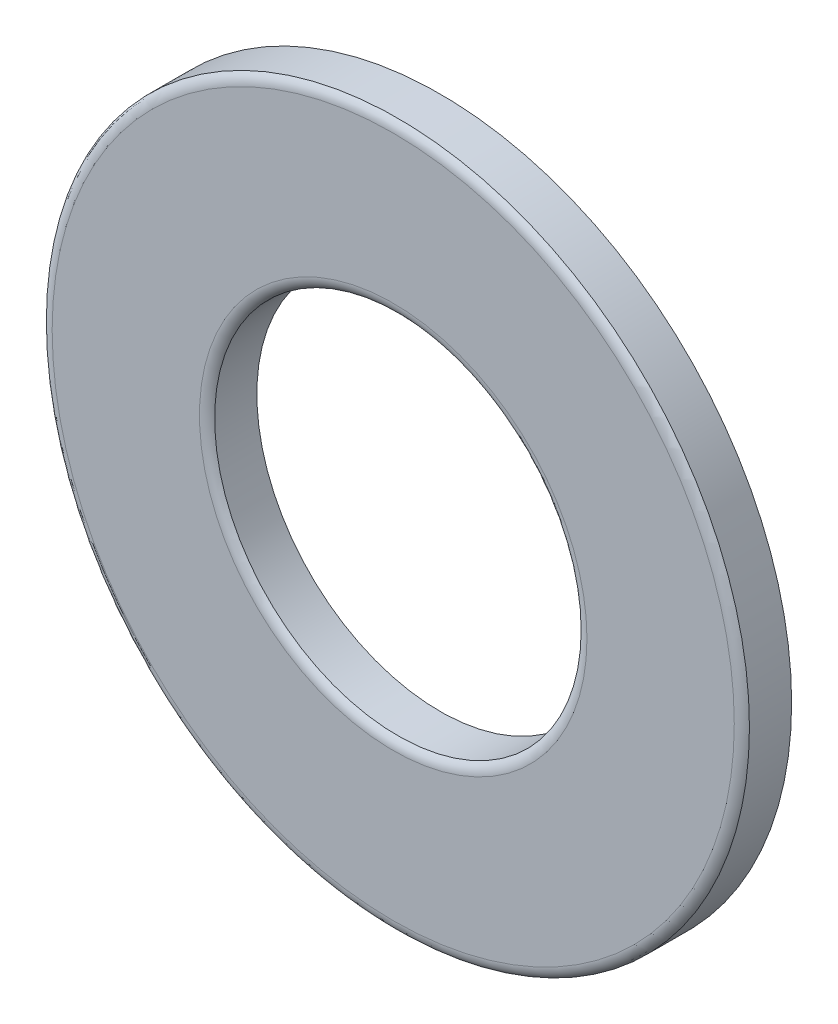
ISO-10303-21;
HEADER;
FILE_DESCRIPTION(('STEP AP214'),'2;1');
FILE_NAME('part.step','',(''),(''),'','','');
FILE_SCHEMA(('AUTOMOTIVE_DESIGN { 1 0 10303 214 1 1 1 1 }'));
ENDSEC;
DATA;
#1=APPLICATION_CONTEXT('core data for automotive mechanical design processes');
#2=APPLICATION_PROTOCOL_DEFINITION('international standard','automotive_design',2000,#1);
#3=PRODUCT_CONTEXT('',#1,'mechanical');
#4=PRODUCT('Part','Part','',(#3));
#5=PRODUCT_RELATED_PRODUCT_CATEGORY('part','',(#4));
#6=PRODUCT_DEFINITION_FORMATION('','',#4);
#7=PRODUCT_DEFINITION_CONTEXT('part definition',#1,'design');
#8=PRODUCT_DEFINITION('design','',#6,#7);
#9=PRODUCT_DEFINITION_SHAPE('','',#8);
#10=(LENGTH_UNIT() NAMED_UNIT(*) SI_UNIT(.MILLI.,.METRE.));
#11=(NAMED_UNIT(*) PLANE_ANGLE_UNIT() SI_UNIT($,.RADIAN.));
#12=(NAMED_UNIT(*) SI_UNIT($,.STERADIAN.) SOLID_ANGLE_UNIT());
#13=UNCERTAINTY_MEASURE_WITH_UNIT(LENGTH_MEASURE(1.E-05),#10,'distance_accuracy_value','');
#14=(GEOMETRIC_REPRESENTATION_CONTEXT(3) GLOBAL_UNCERTAINTY_ASSIGNED_CONTEXT((#13)) GLOBAL_UNIT_ASSIGNED_CONTEXT((#10,
#11,#12)) REPRESENTATION_CONTEXT('',''));
#15=CARTESIAN_POINT('',(0.,0.,0.));
#16=DIRECTION('',(0.,0.,1.));
#17=DIRECTION('',(1.,0.,0.));
#18=AXIS2_PLACEMENT_3D('',#15,#16,#17);
#19=CARTESIAN_POINT('',(0.,0.,0.635000000000001));
#20=DIRECTION('',(0.,0.,1.));
#21=DIRECTION('',(1.,0.,0.));
#22=AXIS2_PLACEMENT_3D('',#19,#20,#21);
#23=PLANE('',#22);
#24=CARTESIAN_POINT('',(0.,0.,0.635000000000001));
#25=DIRECTION('',(0.,0.,1.));
#26=DIRECTION('',(1.,0.,0.));
#27=AXIS2_PLACEMENT_3D('',#24,#25,#26);
#28=CIRCLE('',#27,5.24968063314247);
#29=CARTESIAN_POINT('',(5.24968063314247,0.,0.635000000000001));
#30=VERTEX_POINT('',#29);
#31=EDGE_CURVE('E10',#30,#30,#28,.F.);
#32=ORIENTED_EDGE('',*,*,#31,.T.);
#33=EDGE_LOOP('',(#32));
#34=FACE_BOUND('',#33,.T.);
#35=CARTESIAN_POINT('',(0.,0.,0.635000000000001));
#36=DIRECTION('',(0.,0.,1.));
#37=DIRECTION('',(1.,0.,0.));
#38=AXIS2_PLACEMENT_3D('',#35,#36,#37);
#39=CIRCLE('',#38,9.24101936685753);
#40=CARTESIAN_POINT('',(9.24101936685753,0.,0.635000000000001));
#41=VERTEX_POINT('',#40);
#42=EDGE_CURVE('E41',#41,#41,#39,.T.);
#43=ORIENTED_EDGE('',*,*,#42,.T.);
#44=EDGE_LOOP('',(#43));
#45=FACE_BOUND('',#44,.T.);
#46=ADVANCED_FACE('F34',(#34,#45),#23,.T.);
#47=CARTESIAN_POINT('',(0.,0.,-0.634999999999999));
#48=DIRECTION('',(0.,0.,1.));
#49=DIRECTION('',(1.,0.,0.));
#50=AXIS2_PLACEMENT_3D('',#47,#48,#49);
#51=PLANE('',#50);
#52=CARTESIAN_POINT('',(0.,0.,-0.634999999999999));
#53=DIRECTION('',(0.,0.,1.));
#54=DIRECTION('',(1.,0.,0.));
#55=AXIS2_PLACEMENT_3D('',#52,#53,#54);
#56=CIRCLE('',#55,9.525);
#57=CARTESIAN_POINT('',(9.525,0.,-0.634999999999999));
#58=VERTEX_POINT('',#57);
#59=EDGE_CURVE('E54',#58,#58,#56,.T.);
#60=ORIENTED_EDGE('',*,*,#59,.F.);
#61=EDGE_LOOP('',(#60));
#62=FACE_BOUND('',#61,.T.);
#63=CARTESIAN_POINT('',(0.,0.,-0.634999999999999));
#64=DIRECTION('',(0.,0.,1.));
#65=DIRECTION('',(1.,0.,0.));
#66=AXIS2_PLACEMENT_3D('',#63,#64,#65);
#67=CIRCLE('',#66,4.9657);
#68=CARTESIAN_POINT('',(4.9657,0.,-0.634999999999999));
#69=VERTEX_POINT('',#68);
#70=EDGE_CURVE('E57',#69,#69,#67,.T.);
#71=ORIENTED_EDGE('',*,*,#70,.T.);
#72=EDGE_LOOP('',(#71));
#73=FACE_BOUND('',#72,.T.);
#74=ADVANCED_FACE('F61',(#62,#73),#51,.F.);
#75=CARTESIAN_POINT('',(0.,0.,0.635000000000001));
#76=DIRECTION('',(0.,0.,-1.));
#77=DIRECTION('',(-1.,0.,0.));
#78=AXIS2_PLACEMENT_3D('',#75,#76,#77);
#79=CYLINDRICAL_SURFACE('',#78,9.525);
#80=CARTESIAN_POINT('',(0.,0.,0.508000000000005));
#81=DIRECTION('',(0.,0.,1.));
#82=DIRECTION('',(1.,0.,0.));
#83=AXIS2_PLACEMENT_3D('',#80,#81,#82);
#84=CIRCLE('',#83,9.525);
#85=CARTESIAN_POINT('',(9.525,0.,0.508000000000005));
#86=VERTEX_POINT('',#85);
#87=EDGE_CURVE('E49',#86,#86,#84,.F.);
#88=ORIENTED_EDGE('',*,*,#87,.T.);
#89=EDGE_LOOP('',(#88));
#90=FACE_BOUND('',#89,.T.);
#91=ORIENTED_EDGE('',*,*,#59,.T.);
#92=EDGE_LOOP('',(#91));
#93=FACE_BOUND('',#92,.T.);
#94=ADVANCED_FACE('F66',(#90,#93),#79,.T.);
#95=CARTESIAN_POINT('',(0.,0.,0.635000000000001));
#96=DIRECTION('',(0.,0.,-1.));
#97=DIRECTION('',(-1.,0.,0.));
#98=AXIS2_PLACEMENT_3D('',#95,#96,#97);
#99=CYLINDRICAL_SURFACE('',#98,4.9657);
#100=CARTESIAN_POINT('',(0.,0.,0.508));
#101=DIRECTION('',(0.,0.,1.));
#102=DIRECTION('',(1.,0.,0.));
#103=AXIS2_PLACEMENT_3D('',#100,#101,#102);
#104=CIRCLE('',#103,4.9657);
#105=CARTESIAN_POINT('',(4.9657,0.,0.508));
#106=VERTEX_POINT('',#105);
#107=EDGE_CURVE('E45',#106,#106,#104,.T.);
#108=ORIENTED_EDGE('',*,*,#107,.T.);
#109=EDGE_LOOP('',(#108));
#110=FACE_BOUND('',#109,.T.);
#111=ORIENTED_EDGE('',*,*,#70,.F.);
#112=EDGE_LOOP('',(#111));
#113=FACE_BOUND('',#112,.T.);
#114=ADVANCED_FACE('F63',(#110,#113),#99,.F.);
#115=CARTESIAN_POINT('',(0.,0.,0.254000000000001));
#116=DIRECTION('',(0.,0.,1.));
#117=DIRECTION('',(1.,0.,0.));
#118=AXIS2_PLACEMENT_3D('',#115,#116,#117);
#119=TOROIDAL_SURFACE('',#118,5.24968063314247,0.381);
#120=ORIENTED_EDGE('',*,*,#107,.F.);
#121=EDGE_LOOP('',(#120));
#122=FACE_BOUND('',#121,.T.);
#123=ORIENTED_EDGE('',*,*,#31,.F.);
#124=EDGE_LOOP('',(#123));
#125=FACE_BOUND('',#124,.T.);
#126=ADVANCED_FACE('F65',(#122,#125),#119,.T.);
#127=CARTESIAN_POINT('',(0.,0.,0.254000000000001));
#128=DIRECTION('',(0.,0.,-1.));
#129=DIRECTION('',(-1.,0.,0.));
#130=AXIS2_PLACEMENT_3D('',#127,#128,#129);
#131=TOROIDAL_SURFACE('',#130,9.24101936685753,0.381);
#132=ORIENTED_EDGE('',*,*,#87,.F.);
#133=EDGE_LOOP('',(#132));
#134=FACE_BOUND('',#133,.T.);
#135=ORIENTED_EDGE('',*,*,#42,.F.);
#136=EDGE_LOOP('',(#135));
#137=FACE_BOUND('',#136,.T.);
#138=ADVANCED_FACE('F36',(#134,#137),#131,.T.);
#139=CLOSED_SHELL('',(#46,#74,#94,#114,#126,#138));
#140=MANIFOLD_SOLID_BREP('B2',#139);
#141=ADVANCED_BREP_SHAPE_REPRESENTATION('',(#18,#140),#14);
#142=SHAPE_DEFINITION_REPRESENTATION(#9,#141);
ENDSEC;
END-ISO-10303-21;
